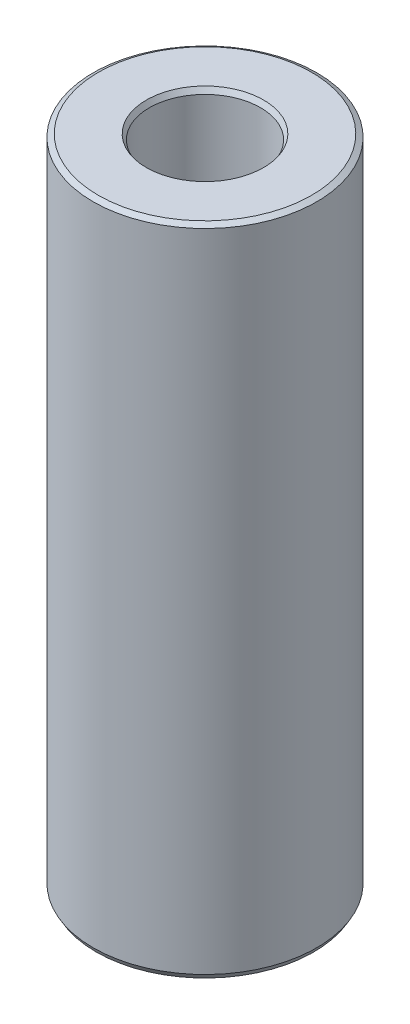
ISO-10303-21;
HEADER;
FILE_DESCRIPTION(('STEP AP214'),'2;1');
FILE_NAME('part.step','',(''),(''),'','','');
FILE_SCHEMA(('AUTOMOTIVE_DESIGN { 1 0 10303 214 1 1 1 1 }'));
ENDSEC;
DATA;
#1=APPLICATION_CONTEXT('core data for automotive mechanical design processes');
#2=APPLICATION_PROTOCOL_DEFINITION('international standard','automotive_design',2000,#1);
#3=PRODUCT_CONTEXT('',#1,'mechanical');
#4=PRODUCT('Part','Part','',(#3));
#5=PRODUCT_RELATED_PRODUCT_CATEGORY('part','',(#4));
#6=PRODUCT_DEFINITION_FORMATION('','',#4);
#7=PRODUCT_DEFINITION_CONTEXT('part definition',#1,'design');
#8=PRODUCT_DEFINITION('design','',#6,#7);
#9=PRODUCT_DEFINITION_SHAPE('','',#8);
#10=(LENGTH_UNIT() NAMED_UNIT(*) SI_UNIT(.MILLI.,.METRE.));
#11=(NAMED_UNIT(*) PLANE_ANGLE_UNIT() SI_UNIT($,.RADIAN.));
#12=(NAMED_UNIT(*) SI_UNIT($,.STERADIAN.) SOLID_ANGLE_UNIT());
#13=UNCERTAINTY_MEASURE_WITH_UNIT(LENGTH_MEASURE(1.E-05),#10,'distance_accuracy_value','');
#14=(GEOMETRIC_REPRESENTATION_CONTEXT(3) GLOBAL_UNCERTAINTY_ASSIGNED_CONTEXT((#13)) GLOBAL_UNIT_ASSIGNED_CONTEXT((#10,
#11,#12)) REPRESENTATION_CONTEXT('',''));
#15=CARTESIAN_POINT('',(0.,0.,0.));
#16=DIRECTION('',(0.,0.,1.));
#17=DIRECTION('',(1.,0.,0.));
#18=AXIS2_PLACEMENT_3D('',#15,#16,#17);
#19=CARTESIAN_POINT('',(0.,277.966833475418,0.));
#20=DIRECTION('',(0.,-1.,0.));
#21=DIRECTION('',(0.,0.,-1.));
#22=AXIS2_PLACEMENT_3D('',#19,#20,#21);
#23=CYLINDRICAL_SURFACE('',#22,47.5);
#24=CARTESIAN_POINT('',(0.,2.1985564027685,0.));
#25=DIRECTION('',(0.,1.,0.));
#26=DIRECTION('',(0.,0.,1.));
#27=AXIS2_PLACEMENT_3D('',#24,#25,#26);
#28=CIRCLE('',#27,47.5);
#29=CARTESIAN_POINT('',(0.,2.1985564027685,47.5));
#30=VERTEX_POINT('',#29);
#31=EDGE_CURVE('E10',#30,#30,#28,.T.);
#32=ORIENTED_EDGE('',*,*,#31,.T.);
#33=EDGE_LOOP('',(#32));
#34=FACE_BOUND('',#33,.T.);
#35=CARTESIAN_POINT('',(0.,276.697496344451,0.));
#36=DIRECTION('',(0.,1.,0.));
#37=DIRECTION('',(0.,0.,1.));
#38=AXIS2_PLACEMENT_3D('',#35,#36,#37);
#39=CIRCLE('',#38,47.5);
#40=CARTESIAN_POINT('',(0.,276.697496344451,47.5));
#41=VERTEX_POINT('',#40);
#42=EDGE_CURVE('E50',#41,#41,#39,.F.);
#43=ORIENTED_EDGE('',*,*,#42,.T.);
#44=EDGE_LOOP('',(#43));
#45=FACE_BOUND('',#44,.T.);
#46=ADVANCED_FACE('F39',(#34,#45),#23,.T.);
#47=CARTESIAN_POINT('',(0.,277.966833475418,0.));
#48=DIRECTION('',(0.,1.,0.));
#49=DIRECTION('',(0.,0.,1.));
#50=AXIS2_PLACEMENT_3D('',#47,#48,#49);
#51=PLANE('',#50);
#52=CARTESIAN_POINT('',(0.,277.966833475418,0.));
#53=DIRECTION('',(0.,1.,0.));
#54=DIRECTION('',(0.,0.,1.));
#55=AXIS2_PLACEMENT_3D('',#52,#53,#54);
#56=CIRCLE('',#55,24.8987151762489);
#57=CARTESIAN_POINT('',(0.,277.966833475418,24.8987151762489));
#58=VERTEX_POINT('',#57);
#59=EDGE_CURVE('E58',#58,#58,#56,.F.);
#60=ORIENTED_EDGE('',*,*,#59,.T.);
#61=EDGE_LOOP('',(#60));
#62=FACE_BOUND('',#61,.T.);
#63=CARTESIAN_POINT('',(0.,277.966833475418,0.));
#64=DIRECTION('',(0.,1.,0.));
#65=DIRECTION('',(0.,0.,1.));
#66=AXIS2_PLACEMENT_3D('',#63,#64,#65);
#67=CIRCLE('',#66,45.3014435972317);
#68=CARTESIAN_POINT('',(0.,277.966833475418,45.3014435972317));
#69=VERTEX_POINT('',#68);
#70=EDGE_CURVE('E61',#69,#69,#67,.T.);
#71=ORIENTED_EDGE('',*,*,#70,.T.);
#72=EDGE_LOOP('',(#71));
#73=FACE_BOUND('',#72,.T.);
#74=ADVANCED_FACE('F88',(#62,#73),#51,.T.);
#75=CARTESIAN_POINT('',(0.,0.,0.));
#76=DIRECTION('',(0.,1.,0.));
#77=DIRECTION('',(0.,0.,1.));
#78=AXIS2_PLACEMENT_3D('',#75,#76,#77);
#79=PLANE('',#78);
#80=CARTESIAN_POINT('',(0.,0.,0.));
#81=DIRECTION('',(0.,1.,0.));
#82=DIRECTION('',(0.,0.,1.));
#83=AXIS2_PLACEMENT_3D('',#80,#81,#82);
#84=CIRCLE('',#83,25.8279344480503);
#85=CARTESIAN_POINT('',(0.,0.,25.8279344480503));
#86=VERTEX_POINT('',#85);
#87=EDGE_CURVE('E51',#86,#86,#84,.T.);
#88=ORIENTED_EDGE('',*,*,#87,.T.);
#89=EDGE_LOOP('',(#88));
#90=FACE_BOUND('',#89,.T.);
#91=CARTESIAN_POINT('',(0.,0.,0.));
#92=DIRECTION('',(0.,1.,0.));
#93=DIRECTION('',(0.,0.,1.));
#94=AXIS2_PLACEMENT_3D('',#91,#92,#93);
#95=CIRCLE('',#94,46.2306628690331);
#96=CARTESIAN_POINT('',(0.,0.,46.2306628690331));
#97=VERTEX_POINT('',#96);
#98=EDGE_CURVE('E54',#97,#97,#95,.F.);
#99=ORIENTED_EDGE('',*,*,#98,.T.);
#100=EDGE_LOOP('',(#99));
#101=FACE_BOUND('',#100,.T.);
#102=ADVANCED_FACE('F83',(#90,#101),#79,.F.);
#103=CARTESIAN_POINT('',(0.,277.966833475418,0.));
#104=DIRECTION('',(0.,-1.,0.));
#105=DIRECTION('',(0.,0.,-1.));
#106=AXIS2_PLACEMENT_3D('',#103,#104,#105);
#107=CYLINDRICAL_SURFACE('',#106,23.629378045282);
#108=CARTESIAN_POINT('',(0.,275.76827707265,0.));
#109=DIRECTION('',(0.,1.,0.));
#110=DIRECTION('',(0.,0.,1.));
#111=AXIS2_PLACEMENT_3D('',#108,#109,#110);
#112=CIRCLE('',#111,23.629378045282);
#113=CARTESIAN_POINT('',(0.,275.76827707265,23.629378045282));
#114=VERTEX_POINT('',#113);
#115=EDGE_CURVE('E67',#114,#114,#112,.T.);
#116=ORIENTED_EDGE('',*,*,#115,.T.);
#117=EDGE_LOOP('',(#116));
#118=FACE_BOUND('',#117,.T.);
#119=CARTESIAN_POINT('',(0.,1.26933713096683,0.));
#120=DIRECTION('',(0.,1.,0.));
#121=DIRECTION('',(0.,0.,1.));
#122=AXIS2_PLACEMENT_3D('',#119,#120,#121);
#123=CIRCLE('',#122,23.629378045282);
#124=CARTESIAN_POINT('',(0.,1.26933713096683,23.629378045282));
#125=VERTEX_POINT('',#124);
#126=EDGE_CURVE('E69',#125,#125,#123,.F.);
#127=ORIENTED_EDGE('',*,*,#126,.T.);
#128=EDGE_LOOP('',(#127));
#129=FACE_BOUND('',#128,.T.);
#130=ADVANCED_FACE('F71',(#118,#129),#107,.F.);
#131=CARTESIAN_POINT('',(0.,275.76827707265,0.));
#132=DIRECTION('',(0.,1.,0.));
#133=DIRECTION('',(0.,0.,1.));
#134=AXIS2_PLACEMENT_3D('',#131,#132,#133);
#135=CONICAL_SURFACE('',#134,23.629378045282,0.523598775598301);
#136=ORIENTED_EDGE('',*,*,#59,.F.);
#137=EDGE_LOOP('',(#136));
#138=FACE_BOUND('',#137,.T.);
#139=ORIENTED_EDGE('',*,*,#115,.F.);
#140=EDGE_LOOP('',(#139));
#141=FACE_BOUND('',#140,.T.);
#142=ADVANCED_FACE('F77',(#138,#141),#135,.F.);
#143=CARTESIAN_POINT('',(0.,0.,0.));
#144=DIRECTION('',(0.,-1.,0.));
#145=DIRECTION('',(0.,0.,-1.));
#146=AXIS2_PLACEMENT_3D('',#143,#144,#145);
#147=CONICAL_SURFACE('',#146,25.8279344480503,1.04719755119659);
#148=ORIENTED_EDGE('',*,*,#126,.F.);
#149=EDGE_LOOP('',(#148));
#150=FACE_BOUND('',#149,.T.);
#151=ORIENTED_EDGE('',*,*,#87,.F.);
#152=EDGE_LOOP('',(#151));
#153=FACE_BOUND('',#152,.T.);
#154=ADVANCED_FACE('F73',(#150,#153),#147,.F.);
#155=CARTESIAN_POINT('',(0.,2.1985564027685,0.));
#156=DIRECTION('',(0.,1.,0.));
#157=DIRECTION('',(0.,0.,1.));
#158=AXIS2_PLACEMENT_3D('',#155,#156,#157);
#159=CONICAL_SURFACE('',#158,47.5,0.523598775598291);
#160=ORIENTED_EDGE('',*,*,#98,.F.);
#161=EDGE_LOOP('',(#160));
#162=FACE_BOUND('',#161,.T.);
#163=ORIENTED_EDGE('',*,*,#31,.F.);
#164=EDGE_LOOP('',(#163));
#165=FACE_BOUND('',#164,.T.);
#166=ADVANCED_FACE('F76',(#162,#165),#159,.T.);
#167=CARTESIAN_POINT('',(0.,277.966833475418,0.));
#168=DIRECTION('',(0.,-1.,0.));
#169=DIRECTION('',(0.,0.,-1.));
#170=AXIS2_PLACEMENT_3D('',#167,#168,#169);
#171=CONICAL_SURFACE('',#170,45.3014435972317,1.04719755119659);
#172=ORIENTED_EDGE('',*,*,#42,.F.);
#173=EDGE_LOOP('',(#172));
#174=FACE_BOUND('',#173,.T.);
#175=ORIENTED_EDGE('',*,*,#70,.F.);
#176=EDGE_LOOP('',(#175));
#177=FACE_BOUND('',#176,.T.);
#178=ADVANCED_FACE('F45',(#174,#177),#171,.T.);
#179=CLOSED_SHELL('',(#46,#74,#102,#130,#142,#154,#166,#178));
#180=MANIFOLD_SOLID_BREP('B2',#179);
#181=ADVANCED_BREP_SHAPE_REPRESENTATION('',(#18,#180),#14);
#182=SHAPE_DEFINITION_REPRESENTATION(#9,#181);
ENDSEC;
END-ISO-10303-21;
